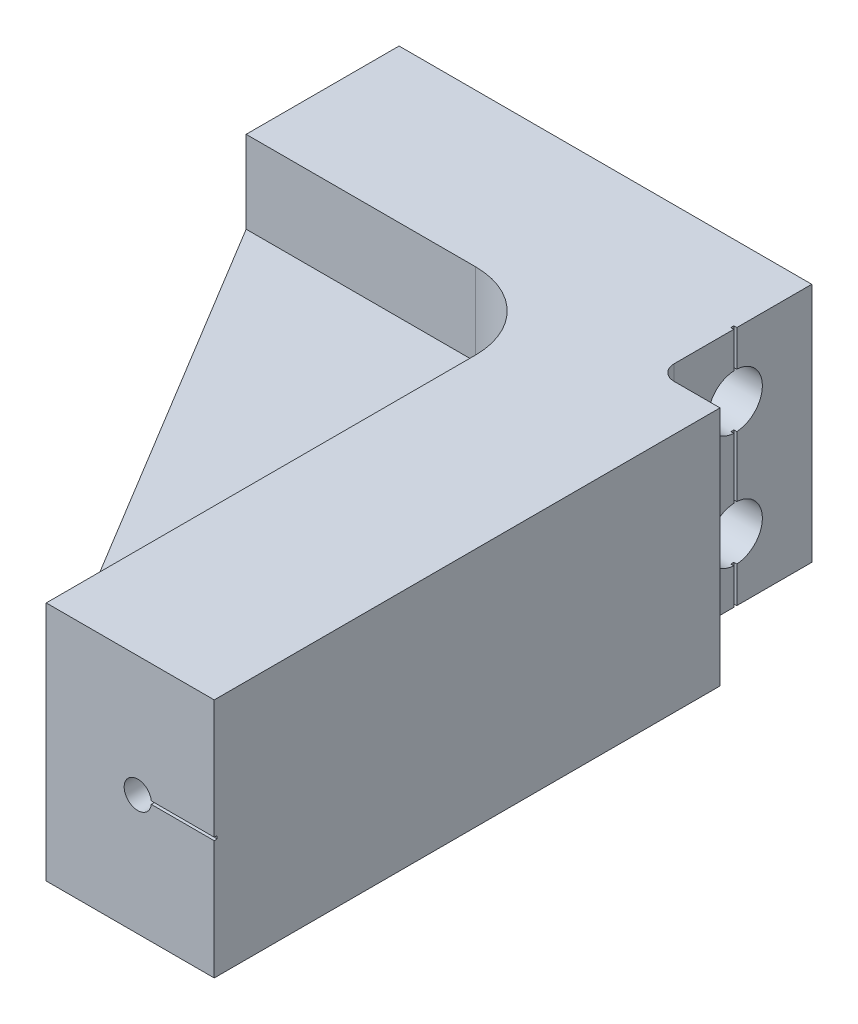
ISO-10303-21;
HEADER;
FILE_DESCRIPTION(('STEP AP214'),'2;1');
FILE_NAME('part.step','',(''),(''),'','','');
FILE_SCHEMA(('AUTOMOTIVE_DESIGN { 1 0 10303 214 1 1 1 1 }'));
ENDSEC;
DATA;
#1=APPLICATION_CONTEXT('core data for automotive mechanical design processes');
#2=APPLICATION_PROTOCOL_DEFINITION('international standard','automotive_design',2000,#1);
#3=PRODUCT_CONTEXT('',#1,'mechanical');
#4=PRODUCT('Part','Part','',(#3));
#5=PRODUCT_RELATED_PRODUCT_CATEGORY('part','',(#4));
#6=PRODUCT_DEFINITION_FORMATION('','',#4);
#7=PRODUCT_DEFINITION_CONTEXT('part definition',#1,'design');
#8=PRODUCT_DEFINITION('design','',#6,#7);
#9=PRODUCT_DEFINITION_SHAPE('','',#8);
#10=(LENGTH_UNIT() NAMED_UNIT(*) SI_UNIT(.MILLI.,.METRE.));
#11=(NAMED_UNIT(*) PLANE_ANGLE_UNIT() SI_UNIT($,.RADIAN.));
#12=(NAMED_UNIT(*) SI_UNIT($,.STERADIAN.) SOLID_ANGLE_UNIT());
#13=UNCERTAINTY_MEASURE_WITH_UNIT(LENGTH_MEASURE(1.E-05),#10,'distance_accuracy_value','');
#14=(GEOMETRIC_REPRESENTATION_CONTEXT(3) GLOBAL_UNCERTAINTY_ASSIGNED_CONTEXT((#13)) GLOBAL_UNIT_ASSIGNED_CONTEXT((#10,
#11,#12)) REPRESENTATION_CONTEXT('',''));
#15=CARTESIAN_POINT('',(0.,0.,0.));
#16=DIRECTION('',(0.,0.,1.));
#17=DIRECTION('',(1.,0.,0.));
#18=AXIS2_PLACEMENT_3D('',#15,#16,#17);
#19=CARTESIAN_POINT('',(10.3,10.,54.6999999999998));
#20=DIRECTION('',(1.,0.,0.));
#21=DIRECTION('',(0.,0.,-0.999999999999998));
#22=AXIS2_PLACEMENT_3D('',#19,#20,#21);
#23=PLANE('',#22);
#24=DIRECTION('',(0.,0.,-0.999999999999998));
#25=VECTOR('',#24,1.);
#26=CARTESIAN_POINT('',(10.3,3.175,54.6999999999998));
#27=LINE('',#26,#25);
#28=CARTESIAN_POINT('',(10.3,3.175,54.6999999999998));
#29=VERTEX_POINT('',#28);
#30=CARTESIAN_POINT('',(10.3,3.175,19.0499999999999));
#31=VERTEX_POINT('',#30);
#32=EDGE_CURVE('E323',#29,#31,#27,.T.);
#33=ORIENTED_EDGE('',*,*,#32,.F.);
#34=DIRECTION('',(0.,-1.,0.));
#35=VECTOR('',#34,1.);
#36=CARTESIAN_POINT('',(10.3,10.,54.6999999999998));
#37=LINE('',#36,#35);
#38=CARTESIAN_POINT('',(10.3,10.,54.6999999999998));
#39=VERTEX_POINT('',#38);
#40=EDGE_CURVE('E457',#39,#29,#37,.T.);
#41=ORIENTED_EDGE('',*,*,#40,.F.);
#42=DIRECTION('',(0.,0.,0.999999999999998));
#43=VECTOR('',#42,1.);
#44=CARTESIAN_POINT('',(10.3,10.,54.6999999999998));
#45=LINE('',#44,#43);
#46=CARTESIAN_POINT('',(10.3,10.,19.0499999999999));
#47=VERTEX_POINT('',#46);
#48=EDGE_CURVE('E453',#47,#39,#45,.T.);
#49=ORIENTED_EDGE('',*,*,#48,.F.);
#50=DIRECTION('',(0.,-1.,0.));
#51=VECTOR('',#50,1.);
#52=CARTESIAN_POINT('',(10.3,10.,19.0499999999999));
#53=LINE('',#52,#51);
#54=EDGE_CURVE('E462',#47,#31,#53,.T.);
#55=ORIENTED_EDGE('',*,*,#54,.T.);
#56=EDGE_LOOP('',(#33,#41,#49,#55));
#57=FACE_BOUND('',#56,.T.);
#58=ADVANCED_FACE('F35',(#57),#23,.F.);
#59=CARTESIAN_POINT('',(3.95,10.,19.0499999999999));
#60=DIRECTION('',(0.,-1.,0.));
#61=DIRECTION('',(0.,0.,-0.999999999999998));
#62=AXIS2_PLACEMENT_3D('',#59,#60,#61);
#63=CYLINDRICAL_SURFACE('',#62,6.35);
#64=CARTESIAN_POINT('',(3.95000000000001,3.175,19.0499999999999));
#65=DIRECTION('',(0.,-1.,0.));
#66=DIRECTION('',(0.,0.,-0.999999999999998));
#67=AXIS2_PLACEMENT_3D('',#64,#65,#66);
#68=CIRCLE('',#67,6.35);
#69=CARTESIAN_POINT('',(3.95000000000001,3.175,12.7));
#70=VERTEX_POINT('',#69);
#71=EDGE_CURVE('E333',#31,#70,#68,.F.);
#72=ORIENTED_EDGE('',*,*,#71,.F.);
#73=ORIENTED_EDGE('',*,*,#54,.F.);
#74=CARTESIAN_POINT('',(3.95,10.,19.0499999999999));
#75=DIRECTION('',(0.,-1.,0.));
#76=DIRECTION('',(0.,0.,-0.999999999999998));
#77=AXIS2_PLACEMENT_3D('',#74,#75,#76);
#78=CIRCLE('',#77,6.35);
#79=CARTESIAN_POINT('',(3.95,10.,12.7));
#80=VERTEX_POINT('',#79);
#81=EDGE_CURVE('E450',#80,#47,#78,.T.);
#82=ORIENTED_EDGE('',*,*,#81,.F.);
#83=DIRECTION('',(0.,-1.,0.));
#84=VECTOR('',#83,1.);
#85=CARTESIAN_POINT('',(3.95,10.,12.7));
#86=LINE('',#85,#84);
#87=EDGE_CURVE('E466',#80,#70,#86,.T.);
#88=ORIENTED_EDGE('',*,*,#87,.T.);
#89=EDGE_LOOP('',(#72,#73,#82,#88));
#90=FACE_BOUND('',#89,.T.);
#91=ADVANCED_FACE('F484',(#90),#63,.F.);
#92=CARTESIAN_POINT('',(0.,10.,12.7));
#93=DIRECTION('',(0.,0.,-0.999999999999998));
#94=DIRECTION('',(-1.,0.,0.));
#95=AXIS2_PLACEMENT_3D('',#92,#93,#94);
#96=PLANE('',#95);
#97=DIRECTION('',(-1.,0.,0.));
#98=VECTOR('',#97,1.);
#99=CARTESIAN_POINT('',(10.3,3.175,12.7));
#100=LINE('',#99,#98);
#101=CARTESIAN_POINT('',(-15.1,3.175,12.7));
#102=VERTEX_POINT('',#101);
#103=EDGE_CURVE('E320',#70,#102,#100,.T.);
#104=ORIENTED_EDGE('',*,*,#103,.F.);
#105=ORIENTED_EDGE('',*,*,#87,.F.);
#106=DIRECTION('',(1.,0.,0.));
#107=VECTOR('',#106,1.);
#108=CARTESIAN_POINT('',(0.,10.,12.7));
#109=LINE('',#108,#107);
#110=CARTESIAN_POINT('',(-15.1,10.,12.7));
#111=VERTEX_POINT('',#110);
#112=EDGE_CURVE('E447',#111,#80,#109,.T.);
#113=ORIENTED_EDGE('',*,*,#112,.F.);
#114=DIRECTION('',(0.,1.,0.));
#115=VECTOR('',#114,1.);
#116=CARTESIAN_POINT('',(-15.1,-10.,12.7));
#117=LINE('',#116,#115);
#118=EDGE_CURVE('E431',#102,#111,#117,.T.);
#119=ORIENTED_EDGE('',*,*,#118,.F.);
#120=EDGE_LOOP('',(#104,#105,#113,#119));
#121=FACE_BOUND('',#120,.T.);
#122=ADVANCED_FACE('F487',(#121),#96,.F.);
#123=CARTESIAN_POINT('',(19.17,-10.,12.7));
#124=DIRECTION('',(1.,0.,0.));
#125=DIRECTION('',(0.,0.,-0.999999999999998));
#126=AXIS2_PLACEMENT_3D('',#123,#124,#125);
#127=PLANE('',#126);
#128=DIRECTION('',(0.,-1.,0.));
#129=VECTOR('',#128,1.);
#130=CARTESIAN_POINT('',(19.17,10.,6.475));
#131=LINE('',#130,#129);
#132=CARTESIAN_POINT('',(19.17,10.,6.475));
#133=VERTEX_POINT('',#132);
#134=CARTESIAN_POINT('',(19.17,7.00692184314802,6.475));
#135=VERTEX_POINT('',#134);
#136=EDGE_CURVE('E335',#133,#135,#131,.T.);
#137=ORIENTED_EDGE('',*,*,#136,.F.);
#138=DIRECTION('',(0.,0.,0.999999999999998));
#139=VECTOR('',#138,1.);
#140=CARTESIAN_POINT('',(19.17,10.,12.7));
#141=LINE('',#140,#139);
#142=CARTESIAN_POINT('',(19.17,10.,11.43));
#143=VERTEX_POINT('',#142);
#144=EDGE_CURVE('E404',#133,#143,#141,.T.);
#145=ORIENTED_EDGE('',*,*,#144,.T.);
#146=DIRECTION('',(0.,-1.,0.));
#147=VECTOR('',#146,1.);
#148=CARTESIAN_POINT('',(19.17,-10.,11.43));
#149=LINE('',#148,#147);
#150=CARTESIAN_POINT('',(19.17,-10.,11.43));
#151=VERTEX_POINT('',#150);
#152=EDGE_CURVE('E274',#143,#151,#149,.T.);
#153=ORIENTED_EDGE('',*,*,#152,.T.);
#154=DIRECTION('',(0.,0.,-0.999999999999998));
#155=VECTOR('',#154,1.);
#156=CARTESIAN_POINT('',(19.17,-10.,12.7));
#157=LINE('',#156,#155);
#158=CARTESIAN_POINT('',(19.17,-10.,6.47499999999999));
#159=VERTEX_POINT('',#158);
#160=EDGE_CURVE('E399',#151,#159,#157,.T.);
#161=ORIENTED_EDGE('',*,*,#160,.T.);
#162=DIRECTION('',(0.,-1.,0.));
#163=VECTOR('',#162,1.);
#164=CARTESIAN_POINT('',(19.17,-10.,6.47499999999999));
#165=LINE('',#164,#163);
#166=CARTESIAN_POINT('',(19.17,-7.00692184314802,6.47499999999999));
#167=VERTEX_POINT('',#166);
#168=EDGE_CURVE('E292',#167,#159,#165,.T.);
#169=ORIENTED_EDGE('',*,*,#168,.F.);
#170=CARTESIAN_POINT('',(19.17,-4.7625,6.34999999999999));
#171=DIRECTION('',(1.,0.,0.));
#172=DIRECTION('',(0.,0.,-0.999999999999998));
#173=AXIS2_PLACEMENT_3D('',#170,#171,#172);
#174=CIRCLE('',#173,2.24789999999999);
#175=CARTESIAN_POINT('',(19.17,-2.51807815685198,6.47499999999999));
#176=VERTEX_POINT('',#175);
#177=EDGE_CURVE('E414',#167,#176,#174,.F.);
#178=ORIENTED_EDGE('',*,*,#177,.T.);
#179=CARTESIAN_POINT('',(19.17,2.51807815685198,6.47499999999999));
#180=VERTEX_POINT('',#179);
#181=EDGE_CURVE('E294',#180,#176,#165,.T.);
#182=ORIENTED_EDGE('',*,*,#181,.F.);
#183=CARTESIAN_POINT('',(19.17,4.7625,6.35));
#184=DIRECTION('',(1.,0.,0.));
#185=DIRECTION('',(0.,0.,-0.999999999999998));
#186=AXIS2_PLACEMENT_3D('',#183,#184,#185);
#187=CIRCLE('',#186,2.24789999999999);
#188=EDGE_CURVE('E278',#180,#135,#187,.F.);
#189=ORIENTED_EDGE('',*,*,#188,.T.);
#190=EDGE_LOOP('',(#137,#145,#153,#161,#169,#178,#182,#189));
#191=FACE_BOUND('',#190,.T.);
#192=ADVANCED_FACE('F527',(#191),#127,.T.);
#193=CARTESIAN_POINT('',(24.25,10.,0.));
#194=DIRECTION('',(0.,0.,-0.999999999999998));
#195=DIRECTION('',(-1.,0.,0.));
#196=AXIS2_PLACEMENT_3D('',#193,#194,#195);
#197=PLANE('',#196);
#198=DIRECTION('',(-1.,0.,0.));
#199=VECTOR('',#198,1.);
#200=CARTESIAN_POINT('',(0.,10.,0.));
#201=LINE('',#200,#199);
#202=CARTESIAN_POINT('',(19.17,10.,0.));
#203=VERTEX_POINT('',#202);
#204=CARTESIAN_POINT('',(-15.1,10.,0.));
#205=VERTEX_POINT('',#204);
#206=EDGE_CURVE('E460',#203,#205,#201,.T.);
#207=ORIENTED_EDGE('',*,*,#206,.F.);
#208=DIRECTION('',(0.,1.,0.));
#209=VECTOR('',#208,1.);
#210=CARTESIAN_POINT('',(19.17,10.,0.));
#211=LINE('',#210,#209);
#212=CARTESIAN_POINT('',(19.17,-10.,0.));
#213=VERTEX_POINT('',#212);
#214=EDGE_CURVE('E402',#213,#203,#211,.T.);
#215=ORIENTED_EDGE('',*,*,#214,.F.);
#216=DIRECTION('',(1.,0.,0.));
#217=VECTOR('',#216,1.);
#218=CARTESIAN_POINT('',(0.,-10.,0.));
#219=LINE('',#218,#217);
#220=CARTESIAN_POINT('',(-15.1,-10.,0.));
#221=VERTEX_POINT('',#220);
#222=EDGE_CURVE('E470',#221,#213,#219,.T.);
#223=ORIENTED_EDGE('',*,*,#222,.F.);
#224=DIRECTION('',(0.,-1.,0.));
#225=VECTOR('',#224,1.);
#226=CARTESIAN_POINT('',(-15.1,-10.,0.));
#227=LINE('',#226,#225);
#228=EDGE_CURVE('E425',#205,#221,#227,.T.);
#229=ORIENTED_EDGE('',*,*,#228,.F.);
#230=EDGE_LOOP('',(#207,#215,#223,#229));
#231=FACE_BOUND('',#230,.T.);
#232=ADVANCED_FACE('F584',(#231),#197,.T.);
#233=CARTESIAN_POINT('',(24.25,-4.7625,6.34999999999999));
#234=DIRECTION('',(1.,0.,0.));
#235=DIRECTION('',(0.,0.,-0.999999999999998));
#236=AXIS2_PLACEMENT_3D('',#233,#234,#235);
#237=CYLINDRICAL_SURFACE('',#236,2.24789999999999);
#238=ORIENTED_EDGE('',*,*,#177,.F.);
#239=DIRECTION('',(1.,0.,0.));
#240=VECTOR('',#239,1.);
#241=CARTESIAN_POINT('',(24.25,-7.00692184314802,6.47499999999999));
#242=LINE('',#241,#240);
#243=CARTESIAN_POINT('',(18.92,-7.00692184314802,6.47499999999999));
#244=VERTEX_POINT('',#243);
#245=EDGE_CURVE('E386',#167,#244,#242,.F.);
#246=ORIENTED_EDGE('',*,*,#245,.T.);
#247=CARTESIAN_POINT('',(18.92,-4.7625,6.34999999999999));
#248=DIRECTION('',(1.,0.,0.));
#249=DIRECTION('',(0.,0.,-0.999999999999998));
#250=AXIS2_PLACEMENT_3D('',#247,#248,#249);
#251=CIRCLE('',#250,2.24789999999999);
#252=CARTESIAN_POINT('',(18.92,-7.00692184314802,6.22499999999999));
#253=VERTEX_POINT('',#252);
#254=EDGE_CURVE('E394',#253,#244,#251,.F.);
#255=ORIENTED_EDGE('',*,*,#254,.F.);
#256=DIRECTION('',(1.,0.,0.));
#257=VECTOR('',#256,1.);
#258=CARTESIAN_POINT('',(24.25,-7.00692184314802,6.22499999999999));
#259=LINE('',#258,#257);
#260=CARTESIAN_POINT('',(19.17,-7.00692184314802,6.22499999999999));
#261=VERTEX_POINT('',#260);
#262=EDGE_CURVE('E371',#253,#261,#259,.T.);
#263=ORIENTED_EDGE('',*,*,#262,.T.);
#264=CARTESIAN_POINT('',(19.17,-2.51807815685198,6.22499999999999));
#265=VERTEX_POINT('',#264);
#266=EDGE_CURVE('E411',#265,#261,#174,.F.);
#267=ORIENTED_EDGE('',*,*,#266,.F.);
#268=DIRECTION('',(1.,0.,0.));
#269=VECTOR('',#268,1.);
#270=CARTESIAN_POINT('',(24.25,-2.51807815685198,6.22499999999999));
#271=LINE('',#270,#269);
#272=CARTESIAN_POINT('',(18.92,-2.51807815685198,6.22499999999999));
#273=VERTEX_POINT('',#272);
#274=EDGE_CURVE('E374',#265,#273,#271,.F.);
#275=ORIENTED_EDGE('',*,*,#274,.T.);
#276=CARTESIAN_POINT('',(18.92,-2.51807815685198,6.47499999999999));
#277=VERTEX_POINT('',#276);
#278=EDGE_CURVE('E392',#277,#273,#251,.F.);
#279=ORIENTED_EDGE('',*,*,#278,.F.);
#280=DIRECTION('',(1.,0.,0.));
#281=VECTOR('',#280,1.);
#282=CARTESIAN_POINT('',(24.25,-2.51807815685198,6.47499999999999));
#283=LINE('',#282,#281);
#284=EDGE_CURVE('E383',#277,#176,#283,.T.);
#285=ORIENTED_EDGE('',*,*,#284,.T.);
#286=EDGE_LOOP('',(#238,#246,#255,#263,#267,#275,#279,#285));
#287=FACE_BOUND('',#286,.T.);
#288=CARTESIAN_POINT('',(-15.1,-4.7625,6.34999999999999));
#289=DIRECTION('',(1.,0.,0.));
#290=DIRECTION('',(0.,0.,-0.999999999999998));
#291=AXIS2_PLACEMENT_3D('',#288,#289,#290);
#292=CIRCLE('',#291,2.24789999999999);
#293=CARTESIAN_POINT('',(-15.1,-4.7625,4.10210000000001));
#294=VERTEX_POINT('',#293);
#295=EDGE_CURVE('E422',#294,#294,#292,.T.);
#296=ORIENTED_EDGE('',*,*,#295,.F.);
#297=EDGE_LOOP('',(#296));
#298=FACE_BOUND('',#297,.T.);
#299=ADVANCED_FACE('F538',(#287,#298),#237,.F.);
#300=CARTESIAN_POINT('',(24.25,4.7625,6.35));
#301=DIRECTION('',(1.,0.,0.));
#302=DIRECTION('',(0.,0.,-0.999999999999998));
#303=AXIS2_PLACEMENT_3D('',#300,#301,#302);
#304=CYLINDRICAL_SURFACE('',#303,2.24789999999999);
#305=ORIENTED_EDGE('',*,*,#188,.F.);
#306=DIRECTION('',(1.,0.,0.));
#307=VECTOR('',#306,1.);
#308=CARTESIAN_POINT('',(24.25,2.51807815685198,6.47499999999999));
#309=LINE('',#308,#307);
#310=CARTESIAN_POINT('',(18.92,2.51807815685198,6.47499999999999));
#311=VERTEX_POINT('',#310);
#312=EDGE_CURVE('E380',#180,#311,#309,.F.);
#313=ORIENTED_EDGE('',*,*,#312,.T.);
#314=CARTESIAN_POINT('',(18.92,4.7625,6.35));
#315=DIRECTION('',(1.,0.,0.));
#316=DIRECTION('',(0.,0.,-0.999999999999998));
#317=AXIS2_PLACEMENT_3D('',#314,#315,#316);
#318=CIRCLE('',#317,2.24789999999999);
#319=CARTESIAN_POINT('',(18.92,2.51807815685198,6.225));
#320=VERTEX_POINT('',#319);
#321=EDGE_CURVE('E391',#320,#311,#318,.F.);
#322=ORIENTED_EDGE('',*,*,#321,.F.);
#323=DIRECTION('',(1.,0.,0.));
#324=VECTOR('',#323,1.);
#325=CARTESIAN_POINT('',(24.25,2.51807815685198,6.225));
#326=LINE('',#325,#324);
#327=CARTESIAN_POINT('',(19.17,2.51807815685198,6.225));
#328=VERTEX_POINT('',#327);
#329=EDGE_CURVE('E358',#320,#328,#326,.T.);
#330=ORIENTED_EDGE('',*,*,#329,.T.);
#331=CARTESIAN_POINT('',(19.17,7.00692184314802,6.225));
#332=VERTEX_POINT('',#331);
#333=EDGE_CURVE('E275',#332,#328,#187,.F.);
#334=ORIENTED_EDGE('',*,*,#333,.F.);
#335=DIRECTION('',(1.,0.,0.));
#336=VECTOR('',#335,1.);
#337=CARTESIAN_POINT('',(24.25,7.00692184314802,6.225));
#338=LINE('',#337,#336);
#339=CARTESIAN_POINT('',(18.92,7.00692184314802,6.225));
#340=VERTEX_POINT('',#339);
#341=EDGE_CURVE('E368',#332,#340,#338,.F.);
#342=ORIENTED_EDGE('',*,*,#341,.T.);
#343=CARTESIAN_POINT('',(18.92,7.00692184314802,6.47499999999999));
#344=VERTEX_POINT('',#343);
#345=EDGE_CURVE('E389',#344,#340,#318,.F.);
#346=ORIENTED_EDGE('',*,*,#345,.F.);
#347=DIRECTION('',(1.,0.,0.));
#348=VECTOR('',#347,1.);
#349=CARTESIAN_POINT('',(24.25,7.00692184314802,6.47499999999999));
#350=LINE('',#349,#348);
#351=EDGE_CURVE('E377',#344,#135,#350,.T.);
#352=ORIENTED_EDGE('',*,*,#351,.T.);
#353=EDGE_LOOP('',(#305,#313,#322,#330,#334,#342,#346,#352));
#354=FACE_BOUND('',#353,.T.);
#355=CARTESIAN_POINT('',(-15.1,4.7625,6.35));
#356=DIRECTION('',(1.,0.,0.));
#357=DIRECTION('',(0.,0.,-0.999999999999998));
#358=AXIS2_PLACEMENT_3D('',#355,#356,#357);
#359=CIRCLE('',#358,2.24789999999999);
#360=CARTESIAN_POINT('',(-15.1,4.7625,4.10210000000002));
#361=VERTEX_POINT('',#360);
#362=EDGE_CURVE('E419',#361,#361,#359,.T.);
#363=ORIENTED_EDGE('',*,*,#362,.F.);
#364=EDGE_LOOP('',(#363));
#365=FACE_BOUND('',#364,.T.);
#366=ADVANCED_FACE('F566',(#354,#365),#304,.F.);
#367=CARTESIAN_POINT('',(0.,10.,54.6999999999998));
#368=DIRECTION('',(0.,-1.,0.));
#369=DIRECTION('',(1.,0.,0.));
#370=AXIS2_PLACEMENT_3D('',#367,#368,#369);
#371=PLANE('',#370);
#372=ORIENTED_EDGE('',*,*,#144,.F.);
#373=DIRECTION('',(1.,0.,0.));
#374=VECTOR('',#373,1.);
#375=CARTESIAN_POINT('',(18.92,10.,6.475));
#376=LINE('',#375,#374);
#377=CARTESIAN_POINT('',(18.92,10.,6.475));
#378=VERTEX_POINT('',#377);
#379=EDGE_CURVE('E356',#378,#133,#376,.T.);
#380=ORIENTED_EDGE('',*,*,#379,.F.);
#381=DIRECTION('',(0.,0.,0.999999999999998));
#382=VECTOR('',#381,1.);
#383=CARTESIAN_POINT('',(18.92,10.,6.475));
#384=LINE('',#383,#382);
#385=CARTESIAN_POINT('',(18.92,10.,6.225));
#386=VERTEX_POINT('',#385);
#387=EDGE_CURVE('E351',#386,#378,#384,.T.);
#388=ORIENTED_EDGE('',*,*,#387,.F.);
#389=DIRECTION('',(1.,0.,0.));
#390=VECTOR('',#389,1.);
#391=CARTESIAN_POINT('',(18.92,10.,6.225));
#392=LINE('',#391,#390);
#393=CARTESIAN_POINT('',(19.17,10.,6.225));
#394=VERTEX_POINT('',#393);
#395=EDGE_CURVE('E359',#386,#394,#392,.T.);
#396=ORIENTED_EDGE('',*,*,#395,.T.);
#397=EDGE_CURVE('E405',#203,#394,#141,.T.);
#398=ORIENTED_EDGE('',*,*,#397,.F.);
#399=ORIENTED_EDGE('',*,*,#206,.T.);
#400=DIRECTION('',(0.,0.,-0.999999999999998));
#401=VECTOR('',#400,1.);
#402=CARTESIAN_POINT('',(-15.1,10.,0.));
#403=LINE('',#402,#401);
#404=EDGE_CURVE('E435',#111,#205,#403,.T.);
#405=ORIENTED_EDGE('',*,*,#404,.F.);
#406=ORIENTED_EDGE('',*,*,#112,.T.);
#407=ORIENTED_EDGE('',*,*,#81,.T.);
#408=ORIENTED_EDGE('',*,*,#48,.T.);
#409=DIRECTION('',(-1.,0.,0.));
#410=VECTOR('',#409,1.);
#411=CARTESIAN_POINT('',(0.,10.,54.6999999999998));
#412=LINE('',#411,#410);
#413=CARTESIAN_POINT('',(24.25,10.,54.6999999999998));
#414=VERTEX_POINT('',#413);
#415=EDGE_CURVE('E266',#414,#39,#412,.T.);
#416=ORIENTED_EDGE('',*,*,#415,.F.);
#417=DIRECTION('',(0.,0.,-0.999999999999998));
#418=VECTOR('',#417,1.);
#419=CARTESIAN_POINT('',(24.25,10.,54.6999999999998));
#420=LINE('',#419,#418);
#421=CARTESIAN_POINT('',(24.25,10.,12.7));
#422=VERTEX_POINT('',#421);
#423=EDGE_CURVE('E261',#414,#422,#420,.T.);
#424=ORIENTED_EDGE('',*,*,#423,.T.);
#425=DIRECTION('',(1.,0.,0.));
#426=VECTOR('',#425,1.);
#427=CARTESIAN_POINT('',(19.17,10.,12.7));
#428=LINE('',#427,#426);
#429=CARTESIAN_POINT('',(20.44,10.,12.7));
#430=VERTEX_POINT('',#429);
#431=EDGE_CURVE('E279',#430,#422,#428,.T.);
#432=ORIENTED_EDGE('',*,*,#431,.F.);
#433=CARTESIAN_POINT('',(20.44,10.,11.43));
#434=DIRECTION('',(0.,-1.,0.));
#435=DIRECTION('',(1.,0.,0.));
#436=AXIS2_PLACEMENT_3D('',#433,#434,#435);
#437=CIRCLE('',#436,1.27);
#438=EDGE_CURVE('E286',#430,#143,#437,.T.);
#439=ORIENTED_EDGE('',*,*,#438,.T.);
#440=EDGE_LOOP('',(#372,#380,#388,#396,#398,#399,#405,#406,#407,#408,#416,#424,#432,#439));
#441=FACE_BOUND('',#440,.T.);
#442=ADVANCED_FACE('F37',(#441),#371,.F.);
#443=CARTESIAN_POINT('',(0.,-10.,54.6999999999998));
#444=DIRECTION('',(0.,1.,0.));
#445=DIRECTION('',(0.,0.,0.999999999999998));
#446=AXIS2_PLACEMENT_3D('',#443,#444,#445);
#447=PLANE('',#446);
#448=DIRECTION('',(0.,0.,-0.999999999999998));
#449=VECTOR('',#448,1.);
#450=CARTESIAN_POINT('',(18.92,-10.,6.47499999999999));
#451=LINE('',#450,#449);
#452=CARTESIAN_POINT('',(18.92,-10.,6.47499999999999));
#453=VERTEX_POINT('',#452);
#454=CARTESIAN_POINT('',(18.92,-10.,6.22499999999999));
#455=VERTEX_POINT('',#454);
#456=EDGE_CURVE('E343',#453,#455,#451,.T.);
#457=ORIENTED_EDGE('',*,*,#456,.F.);
#458=DIRECTION('',(1.,0.,0.));
#459=VECTOR('',#458,1.);
#460=CARTESIAN_POINT('',(18.92,-10.,6.47499999999999));
#461=LINE('',#460,#459);
#462=EDGE_CURVE('E355',#453,#159,#461,.T.);
#463=ORIENTED_EDGE('',*,*,#462,.T.);
#464=ORIENTED_EDGE('',*,*,#160,.F.);
#465=CARTESIAN_POINT('',(20.44,-10.,11.43));
#466=DIRECTION('',(0.,1.,0.));
#467=DIRECTION('',(0.,0.,0.999999999999998));
#468=AXIS2_PLACEMENT_3D('',#465,#466,#467);
#469=CIRCLE('',#468,1.27);
#470=CARTESIAN_POINT('',(20.44,-10.,12.7));
#471=VERTEX_POINT('',#470);
#472=EDGE_CURVE('E284',#151,#471,#469,.T.);
#473=ORIENTED_EDGE('',*,*,#472,.T.);
#474=DIRECTION('',(1.,0.,0.));
#475=VECTOR('',#474,1.);
#476=CARTESIAN_POINT('',(19.17,-10.,12.7));
#477=LINE('',#476,#475);
#478=CARTESIAN_POINT('',(24.25,-10.,12.7));
#479=VERTEX_POINT('',#478);
#480=EDGE_CURVE('E408',#471,#479,#477,.T.);
#481=ORIENTED_EDGE('',*,*,#480,.T.);
#482=DIRECTION('',(0.,0.,-0.999999999999998));
#483=VECTOR('',#482,1.);
#484=CARTESIAN_POINT('',(24.25,-10.,54.6999999999998));
#485=LINE('',#484,#483);
#486=CARTESIAN_POINT('',(24.25,-10.,54.6999999999998));
#487=VERTEX_POINT('',#486);
#488=EDGE_CURVE('E271',#487,#479,#485,.T.);
#489=ORIENTED_EDGE('',*,*,#488,.F.);
#490=DIRECTION('',(1.,0.,0.));
#491=VECTOR('',#490,1.);
#492=CARTESIAN_POINT('',(0.,-10.,54.6999999999998));
#493=LINE('',#492,#491);
#494=CARTESIAN_POINT('',(10.3,-10.,54.6999999999998));
#495=VERTEX_POINT('',#494);
#496=EDGE_CURVE('E264',#495,#487,#493,.T.);
#497=ORIENTED_EDGE('',*,*,#496,.F.);
#498=DIRECTION('',(0.,0.,0.999999999999998));
#499=VECTOR('',#498,1.);
#500=CARTESIAN_POINT('',(10.3,-10.,54.6999999999998));
#501=LINE('',#500,#499);
#502=CARTESIAN_POINT('',(10.3,-10.,19.0499999999999));
#503=VERTEX_POINT('',#502);
#504=EDGE_CURVE('E444',#503,#495,#501,.T.);
#505=ORIENTED_EDGE('',*,*,#504,.F.);
#506=CARTESIAN_POINT('',(3.95000000000001,-10.,19.0499999999999));
#507=DIRECTION('',(0.,-1.,0.));
#508=DIRECTION('',(0.,0.,-0.999999999999998));
#509=AXIS2_PLACEMENT_3D('',#506,#507,#508);
#510=CIRCLE('',#509,6.35);
#511=CARTESIAN_POINT('',(3.95000000000001,-10.,12.7));
#512=VERTEX_POINT('',#511);
#513=EDGE_CURVE('E441',#512,#503,#510,.T.);
#514=ORIENTED_EDGE('',*,*,#513,.F.);
#515=DIRECTION('',(1.,0.,0.));
#516=VECTOR('',#515,1.);
#517=CARTESIAN_POINT('',(0.,-10.,12.7));
#518=LINE('',#517,#516);
#519=CARTESIAN_POINT('',(-15.1,-10.,12.7));
#520=VERTEX_POINT('',#519);
#521=EDGE_CURVE('E438',#520,#512,#518,.T.);
#522=ORIENTED_EDGE('',*,*,#521,.F.);
#523=DIRECTION('',(0.,0.,0.999999999999998));
#524=VECTOR('',#523,1.);
#525=CARTESIAN_POINT('',(-15.1,-10.,0.));
#526=LINE('',#525,#524);
#527=EDGE_CURVE('E428',#221,#520,#526,.T.);
#528=ORIENTED_EDGE('',*,*,#527,.F.);
#529=ORIENTED_EDGE('',*,*,#222,.T.);
#530=CARTESIAN_POINT('',(19.17,-10.,6.22499999999999));
#531=VERTEX_POINT('',#530);
#532=EDGE_CURVE('E398',#531,#213,#157,.T.);
#533=ORIENTED_EDGE('',*,*,#532,.F.);
#534=DIRECTION('',(1.,0.,0.));
#535=VECTOR('',#534,1.);
#536=CARTESIAN_POINT('',(18.92,-10.,6.22499999999999));
#537=LINE('',#536,#535);
#538=EDGE_CURVE('E362',#455,#531,#537,.T.);
#539=ORIENTED_EDGE('',*,*,#538,.F.);
#540=EDGE_LOOP('',(#457,#463,#464,#473,#481,#489,#497,#505,#514,#522,#528,#529,#533,#539));
#541=FACE_BOUND('',#540,.T.);
#542=ADVANCED_FACE('F514',(#541),#447,.F.);
#543=CARTESIAN_POINT('',(24.25,10.,54.6999999999998));
#544=DIRECTION('',(-1.,0.,0.));
#545=DIRECTION('',(0.,0.,0.999999999999998));
#546=AXIS2_PLACEMENT_3D('',#543,#544,#545);
#547=PLANE('',#546);
#548=DIRECTION('',(0.,1.,0.));
#549=VECTOR('',#548,1.);
#550=CARTESIAN_POINT('',(24.25,0.125,54.4499999999998));
#551=LINE('',#550,#549);
#552=CARTESIAN_POINT('',(24.25,-0.125,54.4499999999998));
#553=VERTEX_POINT('',#552);
#554=CARTESIAN_POINT('',(24.25,0.125,54.4499999999998));
#555=VERTEX_POINT('',#554);
#556=EDGE_CURVE('E307',#553,#555,#551,.T.);
#557=ORIENTED_EDGE('',*,*,#556,.F.);
#558=DIRECTION('',(0.,0.,0.999999999999998));
#559=VECTOR('',#558,1.);
#560=CARTESIAN_POINT('',(24.25,-0.125,54.4499999999998));
#561=LINE('',#560,#559);
#562=CARTESIAN_POINT('',(24.25,-0.125,54.6999999999998));
#563=VERTEX_POINT('',#562);
#564=EDGE_CURVE('E243',#553,#563,#561,.T.);
#565=ORIENTED_EDGE('',*,*,#564,.T.);
#566=DIRECTION('',(0.,1.,0.));
#567=VECTOR('',#566,1.);
#568=CARTESIAN_POINT('',(24.25,10.,54.6999999999998));
#569=LINE('',#568,#567);
#570=EDGE_CURVE('E263',#487,#563,#569,.T.);
#571=ORIENTED_EDGE('',*,*,#570,.F.);
#572=ORIENTED_EDGE('',*,*,#488,.T.);
#573=DIRECTION('',(0.,-1.,0.));
#574=VECTOR('',#573,1.);
#575=CARTESIAN_POINT('',(24.25,10.,12.7));
#576=LINE('',#575,#574);
#577=EDGE_CURVE('E395',#422,#479,#576,.T.);
#578=ORIENTED_EDGE('',*,*,#577,.F.);
#579=ORIENTED_EDGE('',*,*,#423,.F.);
#580=CARTESIAN_POINT('',(24.25,0.125,54.6999999999998));
#581=VERTEX_POINT('',#580);
#582=EDGE_CURVE('E251',#581,#414,#569,.T.);
#583=ORIENTED_EDGE('',*,*,#582,.F.);
#584=DIRECTION('',(0.,0.,0.999999999999998));
#585=VECTOR('',#584,1.);
#586=CARTESIAN_POINT('',(24.25,0.125,54.4499999999998));
#587=LINE('',#586,#585);
#588=EDGE_CURVE('E235',#555,#581,#587,.T.);
#589=ORIENTED_EDGE('',*,*,#588,.F.);
#590=EDGE_LOOP('',(#557,#565,#571,#572,#578,#579,#583,#589));
#591=FACE_BOUND('',#590,.T.);
#592=ADVANCED_FACE('F258',(#591),#547,.F.);
#593=CARTESIAN_POINT('',(24.25,10.,54.6999999999998));
#594=DIRECTION('',(0.,0.,-0.999999999999998));
#595=DIRECTION('',(-1.,0.,0.));
#596=AXIS2_PLACEMENT_3D('',#593,#594,#595);
#597=PLANE('',#596);
#598=ORIENTED_EDGE('',*,*,#570,.T.);
#599=DIRECTION('',(1.,0.,0.));
#600=VECTOR('',#599,1.);
#601=CARTESIAN_POINT('',(24.25,-0.125,54.6999999999998));
#602=LINE('',#601,#600);
#603=CARTESIAN_POINT('',(19.0233668545938,-0.125000000000001,54.6999999999998));
#604=VERTEX_POINT('',#603);
#605=EDGE_CURVE('E256',#604,#563,#602,.T.);
#606=ORIENTED_EDGE('',*,*,#605,.F.);
#607=CARTESIAN_POINT('',(17.9,0.,54.6999999999998));
#608=DIRECTION('',(0.,0.,0.999999999999998));
#609=DIRECTION('',(1.,0.,0.));
#610=AXIS2_PLACEMENT_3D('',#607,#608,#609);
#611=CIRCLE('',#610,1.13029999999999);
#612=CARTESIAN_POINT('',(19.0233668545938,0.125000000000001,54.6999999999998));
#613=VERTEX_POINT('',#612);
#614=EDGE_CURVE('E255',#613,#604,#611,.T.);
#615=ORIENTED_EDGE('',*,*,#614,.F.);
#616=DIRECTION('',(-1.,0.,0.));
#617=VECTOR('',#616,1.);
#618=CARTESIAN_POINT('',(24.25,0.125,54.6999999999998));
#619=LINE('',#618,#617);
#620=EDGE_CURVE('E238',#581,#613,#619,.T.);
#621=ORIENTED_EDGE('',*,*,#620,.F.);
#622=ORIENTED_EDGE('',*,*,#582,.T.);
#623=ORIENTED_EDGE('',*,*,#415,.T.);
#624=ORIENTED_EDGE('',*,*,#40,.T.);
#625=DIRECTION('',(0.,-1.,0.));
#626=VECTOR('',#625,1.);
#627=CARTESIAN_POINT('',(10.3,3.175,54.6999999999998));
#628=LINE('',#627,#626);
#629=CARTESIAN_POINT('',(10.3,-3.175,54.6999999999998));
#630=VERTEX_POINT('',#629);
#631=EDGE_CURVE('E325',#29,#630,#628,.T.);
#632=ORIENTED_EDGE('',*,*,#631,.T.);
#633=EDGE_CURVE('E461',#630,#495,#37,.T.);
#634=ORIENTED_EDGE('',*,*,#633,.T.);
#635=ORIENTED_EDGE('',*,*,#496,.T.);
#636=EDGE_LOOP('',(#598,#606,#615,#621,#622,#623,#624,#632,#634,#635));
#637=FACE_BOUND('',#636,.T.);
#638=ADVANCED_FACE('F249',(#637),#597,.F.);
#639=ORIENTED_EDGE('',*,*,#633,.F.);
#640=DIRECTION('',(0.,0.,-0.999999999999998));
#641=VECTOR('',#640,1.);
#642=CARTESIAN_POINT('',(10.3,-3.175,54.6999999999998));
#643=LINE('',#642,#641);
#644=CARTESIAN_POINT('',(10.3,-3.175,19.0499999999999));
#645=VERTEX_POINT('',#644);
#646=EDGE_CURVE('E317',#630,#645,#643,.T.);
#647=ORIENTED_EDGE('',*,*,#646,.T.);
#648=EDGE_CURVE('E465',#645,#503,#53,.T.);
#649=ORIENTED_EDGE('',*,*,#648,.T.);
#650=ORIENTED_EDGE('',*,*,#504,.T.);
#651=EDGE_LOOP('',(#639,#647,#649,#650));
#652=FACE_BOUND('',#651,.T.);
#653=ADVANCED_FACE('F508',(#652),#23,.F.);
#654=ORIENTED_EDGE('',*,*,#648,.F.);
#655=CARTESIAN_POINT('',(3.95000000000001,-3.175,19.0499999999999));
#656=DIRECTION('',(0.,-1.,0.));
#657=DIRECTION('',(0.,0.,-0.999999999999998));
#658=AXIS2_PLACEMENT_3D('',#655,#656,#657);
#659=CIRCLE('',#658,6.35);
#660=CARTESIAN_POINT('',(3.95000000000001,-3.175,12.7));
#661=VERTEX_POINT('',#660);
#662=EDGE_CURVE('E330',#645,#661,#659,.F.);
#663=ORIENTED_EDGE('',*,*,#662,.T.);
#664=EDGE_CURVE('E456',#661,#512,#86,.T.);
#665=ORIENTED_EDGE('',*,*,#664,.T.);
#666=ORIENTED_EDGE('',*,*,#513,.T.);
#667=EDGE_LOOP('',(#654,#663,#665,#666));
#668=FACE_BOUND('',#667,.T.);
#669=ADVANCED_FACE('F503',(#668),#63,.F.);
#670=ORIENTED_EDGE('',*,*,#664,.F.);
#671=DIRECTION('',(-1.,0.,0.));
#672=VECTOR('',#671,1.);
#673=CARTESIAN_POINT('',(10.3,-3.175,12.7));
#674=LINE('',#673,#672);
#675=CARTESIAN_POINT('',(-15.1,-3.175,12.7));
#676=VERTEX_POINT('',#675);
#677=EDGE_CURVE('E311',#661,#676,#674,.T.);
#678=ORIENTED_EDGE('',*,*,#677,.T.);
#679=EDGE_CURVE('E432',#520,#676,#117,.T.);
#680=ORIENTED_EDGE('',*,*,#679,.F.);
#681=ORIENTED_EDGE('',*,*,#521,.T.);
#682=EDGE_LOOP('',(#670,#678,#680,#681));
#683=FACE_BOUND('',#682,.T.);
#684=ADVANCED_FACE('F498',(#683),#96,.F.);
#685=CARTESIAN_POINT('',(-15.1,10.,0.));
#686=DIRECTION('',(1.,0.,0.));
#687=DIRECTION('',(0.,0.,-0.999999999999998));
#688=AXIS2_PLACEMENT_3D('',#685,#686,#687);
#689=PLANE('',#688);
#690=ORIENTED_EDGE('',*,*,#362,.T.);
#691=EDGE_LOOP('',(#690));
#692=FACE_BOUND('',#691,.T.);
#693=ORIENTED_EDGE('',*,*,#295,.T.);
#694=EDGE_LOOP('',(#693));
#695=FACE_BOUND('',#694,.T.);
#696=ORIENTED_EDGE('',*,*,#228,.T.);
#697=ORIENTED_EDGE('',*,*,#527,.T.);
#698=ORIENTED_EDGE('',*,*,#679,.T.);
#699=DIRECTION('',(0.,-1.,0.));
#700=VECTOR('',#699,1.);
#701=CARTESIAN_POINT('',(-15.1,3.175,12.7));
#702=LINE('',#701,#700);
#703=EDGE_CURVE('E328',#102,#676,#702,.T.);
#704=ORIENTED_EDGE('',*,*,#703,.F.);
#705=ORIENTED_EDGE('',*,*,#118,.T.);
#706=ORIENTED_EDGE('',*,*,#404,.T.);
#707=EDGE_LOOP('',(#696,#697,#698,#704,#705,#706));
#708=FACE_BOUND('',#707,.T.);
#709=ADVANCED_FACE('F492',(#692,#695,#708),#689,.F.);
#710=CARTESIAN_POINT('',(17.9,0.,54.6999999999998));
#711=DIRECTION('',(0.,0.,0.999999999999998));
#712=DIRECTION('',(1.,0.,0.));
#713=AXIS2_PLACEMENT_3D('',#710,#711,#712);
#714=CYLINDRICAL_SURFACE('',#713,1.13029999999999);
#715=ORIENTED_EDGE('',*,*,#614,.T.);
#716=DIRECTION('',(0.,0.,0.999999999999998));
#717=VECTOR('',#716,1.);
#718=CARTESIAN_POINT('',(19.0233668545938,-0.125000000000001,54.6999999999998));
#719=LINE('',#718,#717);
#720=CARTESIAN_POINT('',(19.0233668545938,-0.125000000000001,54.4499999999998));
#721=VERTEX_POINT('',#720);
#722=EDGE_CURVE('E11',#604,#721,#719,.F.);
#723=ORIENTED_EDGE('',*,*,#722,.T.);
#724=CARTESIAN_POINT('',(17.9,0.,54.4499999999998));
#725=DIRECTION('',(0.,0.,-0.999999999999998));
#726=DIRECTION('',(-1.,0.,0.));
#727=AXIS2_PLACEMENT_3D('',#724,#725,#726);
#728=CIRCLE('',#727,1.13029999999999);
#729=CARTESIAN_POINT('',(19.0233668545938,0.125000000000001,54.4499999999998));
#730=VERTEX_POINT('',#729);
#731=EDGE_CURVE('E295',#721,#730,#728,.F.);
#732=ORIENTED_EDGE('',*,*,#731,.T.);
#733=DIRECTION('',(0.,0.,0.999999999999998));
#734=VECTOR('',#733,1.);
#735=CARTESIAN_POINT('',(19.0233668545938,0.125000000000001,54.6999999999998));
#736=LINE('',#735,#734);
#737=EDGE_CURVE('E43',#730,#613,#736,.T.);
#738=ORIENTED_EDGE('',*,*,#737,.T.);
#739=EDGE_LOOP('',(#715,#723,#732,#738));
#740=FACE_BOUND('',#739,.T.);
#741=CARTESIAN_POINT('',(17.9,0.,45.8353999999999));
#742=DIRECTION('',(0.,0.,0.999999999999998));
#743=DIRECTION('',(1.,0.,0.));
#744=AXIS2_PLACEMENT_3D('',#741,#742,#743);
#745=CIRCLE('',#744,1.13029999999999);
#746=CARTESIAN_POINT('',(19.0303,0.,45.8353999999999));
#747=VERTEX_POINT('',#746);
#748=EDGE_CURVE('E415',#747,#747,#745,.T.);
#749=ORIENTED_EDGE('',*,*,#748,.F.);
#750=EDGE_LOOP('',(#749));
#751=FACE_BOUND('',#750,.T.);
#752=ADVANCED_FACE('F298',(#740,#751),#714,.F.);
#753=CARTESIAN_POINT('',(17.9,0.,45.8353999999999));
#754=DIRECTION('',(0.,0.,0.999999999999998));
#755=DIRECTION('',(1.,0.,0.));
#756=AXIS2_PLACEMENT_3D('',#753,#754,#755);
#757=CONICAL_SURFACE('',#756,1.13029999999999,1.02974425867665);
#758=CARTESIAN_POINT('',(17.9,0.,45.1562472423131));
#759=VERTEX_POINT('',#758);
#760=VERTEX_LOOP('',#759);
#761=FACE_BOUND('',#760,.T.);
#762=ORIENTED_EDGE('',*,*,#748,.T.);
#763=EDGE_LOOP('',(#762));
#764=FACE_BOUND('',#763,.T.);
#765=ADVANCED_FACE('F638',(#761,#764),#757,.F.);
#766=DIRECTION('',(0.,1.,0.));
#767=VECTOR('',#766,1.);
#768=CARTESIAN_POINT('',(19.17,10.,6.225));
#769=LINE('',#768,#767);
#770=EDGE_CURVE('E337',#531,#261,#769,.T.);
#771=ORIENTED_EDGE('',*,*,#770,.F.);
#772=ORIENTED_EDGE('',*,*,#532,.T.);
#773=ORIENTED_EDGE('',*,*,#214,.T.);
#774=ORIENTED_EDGE('',*,*,#397,.T.);
#775=DIRECTION('',(0.,1.,0.));
#776=VECTOR('',#775,1.);
#777=CARTESIAN_POINT('',(19.17,-10.,6.22499999999999));
#778=LINE('',#777,#776);
#779=EDGE_CURVE('E289',#332,#394,#778,.T.);
#780=ORIENTED_EDGE('',*,*,#779,.F.);
#781=ORIENTED_EDGE('',*,*,#333,.T.);
#782=EDGE_CURVE('E291',#265,#328,#778,.T.);
#783=ORIENTED_EDGE('',*,*,#782,.F.);
#784=ORIENTED_EDGE('',*,*,#266,.T.);
#785=EDGE_LOOP('',(#771,#772,#773,#774,#780,#781,#783,#784));
#786=FACE_BOUND('',#785,.T.);
#787=ADVANCED_FACE('F558',(#786),#127,.T.);
#788=CARTESIAN_POINT('',(19.17,10.,12.7));
#789=DIRECTION('',(0.,0.,0.999999999999998));
#790=DIRECTION('',(0.,-1.,0.));
#791=AXIS2_PLACEMENT_3D('',#788,#789,#790);
#792=PLANE('',#791);
#793=ORIENTED_EDGE('',*,*,#480,.F.);
#794=DIRECTION('',(0.,-1.,0.));
#795=VECTOR('',#794,1.);
#796=CARTESIAN_POINT('',(20.44,10.,12.7));
#797=LINE('',#796,#795);
#798=EDGE_CURVE('E282',#471,#430,#797,.F.);
#799=ORIENTED_EDGE('',*,*,#798,.T.);
#800=ORIENTED_EDGE('',*,*,#431,.T.);
#801=ORIENTED_EDGE('',*,*,#577,.T.);
#802=EDGE_LOOP('',(#793,#799,#800,#801));
#803=FACE_BOUND('',#802,.T.);
#804=ADVANCED_FACE('F518',(#803),#792,.F.);
#805=CARTESIAN_POINT('',(20.44,-10.,11.43));
#806=DIRECTION('',(0.,-1.,0.));
#807=DIRECTION('',(0.,0.,-0.999999999999998));
#808=AXIS2_PLACEMENT_3D('',#805,#806,#807);
#809=CYLINDRICAL_SURFACE('',#808,1.27);
#810=ORIENTED_EDGE('',*,*,#438,.F.);
#811=ORIENTED_EDGE('',*,*,#798,.F.);
#812=ORIENTED_EDGE('',*,*,#472,.F.);
#813=ORIENTED_EDGE('',*,*,#152,.F.);
#814=EDGE_LOOP('',(#810,#811,#812,#813));
#815=FACE_BOUND('',#814,.T.);
#816=ADVANCED_FACE('F523',(#815),#809,.F.);
#817=CARTESIAN_POINT('',(18.92,10.,6.225));
#818=DIRECTION('',(0.,0.,-0.999999999999998));
#819=DIRECTION('',(0.,1.,0.));
#820=AXIS2_PLACEMENT_3D('',#817,#818,#819);
#821=PLANE('',#820);
#822=ORIENTED_EDGE('',*,*,#779,.T.);
#823=ORIENTED_EDGE('',*,*,#395,.F.);
#824=DIRECTION('',(0.,1.,0.));
#825=VECTOR('',#824,1.);
#826=CARTESIAN_POINT('',(18.92,10.,6.225));
#827=LINE('',#826,#825);
#828=EDGE_CURVE('E347',#340,#386,#827,.T.);
#829=ORIENTED_EDGE('',*,*,#828,.F.);
#830=ORIENTED_EDGE('',*,*,#341,.F.);
#831=EDGE_LOOP('',(#822,#823,#829,#830));
#832=FACE_BOUND('',#831,.T.);
#833=ADVANCED_FACE('F579',(#832),#821,.F.);
#834=CARTESIAN_POINT('',(18.92,10.,6.475));
#835=DIRECTION('',(0.,0.,0.999999999999998));
#836=DIRECTION('',(0.,-1.,0.));
#837=AXIS2_PLACEMENT_3D('',#834,#835,#836);
#838=PLANE('',#837);
#839=DIRECTION('',(0.,-1.,0.));
#840=VECTOR('',#839,1.);
#841=CARTESIAN_POINT('',(18.92,10.,6.475));
#842=LINE('',#841,#840);
#843=EDGE_CURVE('E340',#378,#344,#842,.T.);
#844=ORIENTED_EDGE('',*,*,#843,.F.);
#845=ORIENTED_EDGE('',*,*,#379,.T.);
#846=ORIENTED_EDGE('',*,*,#136,.T.);
#847=ORIENTED_EDGE('',*,*,#351,.F.);
#848=EDGE_LOOP('',(#844,#845,#846,#847));
#849=FACE_BOUND('',#848,.T.);
#850=ADVANCED_FACE('F572',(#849),#838,.F.);
#851=CARTESIAN_POINT('',(18.92,-10.,6.47499999999999));
#852=DIRECTION('',(1.,0.,0.));
#853=DIRECTION('',(0.,0.,-0.999999999999998));
#854=AXIS2_PLACEMENT_3D('',#851,#852,#853);
#855=PLANE('',#854);
#856=ORIENTED_EDGE('',*,*,#345,.T.);
#857=ORIENTED_EDGE('',*,*,#828,.T.);
#858=ORIENTED_EDGE('',*,*,#387,.T.);
#859=ORIENTED_EDGE('',*,*,#843,.T.);
#860=EDGE_LOOP('',(#856,#857,#858,#859));
#861=FACE_BOUND('',#860,.T.);
#862=ADVANCED_FACE('F575',(#861),#855,.T.);
#863=ORIENTED_EDGE('',*,*,#782,.T.);
#864=ORIENTED_EDGE('',*,*,#329,.F.);
#865=EDGE_CURVE('E352',#273,#320,#827,.T.);
#866=ORIENTED_EDGE('',*,*,#865,.F.);
#867=ORIENTED_EDGE('',*,*,#274,.F.);
#868=EDGE_LOOP('',(#863,#864,#866,#867));
#869=FACE_BOUND('',#868,.T.);
#870=ADVANCED_FACE('F563',(#869),#821,.F.);
#871=EDGE_CURVE('E344',#311,#277,#842,.T.);
#872=ORIENTED_EDGE('',*,*,#871,.F.);
#873=ORIENTED_EDGE('',*,*,#312,.F.);
#874=ORIENTED_EDGE('',*,*,#181,.T.);
#875=ORIENTED_EDGE('',*,*,#284,.F.);
#876=EDGE_LOOP('',(#872,#873,#874,#875));
#877=FACE_BOUND('',#876,.T.);
#878=ADVANCED_FACE('F545',(#877),#838,.F.);
#879=ORIENTED_EDGE('',*,*,#278,.T.);
#880=ORIENTED_EDGE('',*,*,#865,.T.);
#881=ORIENTED_EDGE('',*,*,#321,.T.);
#882=ORIENTED_EDGE('',*,*,#871,.T.);
#883=EDGE_LOOP('',(#879,#880,#881,#882));
#884=FACE_BOUND('',#883,.T.);
#885=ADVANCED_FACE('F547',(#884),#855,.T.);
#886=ORIENTED_EDGE('',*,*,#254,.T.);
#887=EDGE_CURVE('E339',#244,#453,#842,.T.);
#888=ORIENTED_EDGE('',*,*,#887,.T.);
#889=ORIENTED_EDGE('',*,*,#456,.T.);
#890=EDGE_CURVE('E348',#455,#253,#827,.T.);
#891=ORIENTED_EDGE('',*,*,#890,.T.);
#892=EDGE_LOOP('',(#886,#888,#889,#891));
#893=FACE_BOUND('',#892,.T.);
#894=ADVANCED_FACE('F552',(#893),#855,.T.);
#895=ORIENTED_EDGE('',*,*,#168,.T.);
#896=ORIENTED_EDGE('',*,*,#462,.F.);
#897=ORIENTED_EDGE('',*,*,#887,.F.);
#898=ORIENTED_EDGE('',*,*,#245,.F.);
#899=EDGE_LOOP('',(#895,#896,#897,#898));
#900=FACE_BOUND('',#899,.T.);
#901=ADVANCED_FACE('F533',(#900),#838,.F.);
#902=ORIENTED_EDGE('',*,*,#890,.F.);
#903=ORIENTED_EDGE('',*,*,#538,.T.);
#904=ORIENTED_EDGE('',*,*,#770,.T.);
#905=ORIENTED_EDGE('',*,*,#262,.F.);
#906=EDGE_LOOP('',(#902,#903,#904,#905));
#907=FACE_BOUND('',#906,.T.);
#908=ADVANCED_FACE('F587',(#907),#821,.F.);
#909=CARTESIAN_POINT('',(10.3,3.175,12.7));
#910=DIRECTION('',(0.,-1.,0.));
#911=DIRECTION('',(0.,0.,-0.999999999999998));
#912=AXIS2_PLACEMENT_3D('',#909,#910,#911);
#913=PLANE('',#912);
#914=ORIENTED_EDGE('',*,*,#32,.T.);
#915=ORIENTED_EDGE('',*,*,#71,.T.);
#916=ORIENTED_EDGE('',*,*,#103,.T.);
#917=DIRECTION('',(0.517488728383897,0.,0.855690023311954));
#918=VECTOR('',#917,1.);
#919=CARTESIAN_POINT('',(-15.1,3.175,12.7));
#920=LINE('',#919,#918);
#921=EDGE_CURVE('E58',#102,#29,#920,.T.);
#922=ORIENTED_EDGE('',*,*,#921,.T.);
#923=EDGE_LOOP('',(#914,#915,#916,#922));
#924=FACE_BOUND('',#923,.T.);
#925=ADVANCED_FACE('F481',(#924),#913,.F.);
#926=CARTESIAN_POINT('',(10.3,-3.175,12.7));
#927=DIRECTION('',(0.,-1.,0.));
#928=DIRECTION('',(0.,0.,-0.999999999999998));
#929=AXIS2_PLACEMENT_3D('',#926,#927,#928);
#930=PLANE('',#929);
#931=ORIENTED_EDGE('',*,*,#662,.F.);
#932=ORIENTED_EDGE('',*,*,#646,.F.);
#933=DIRECTION('',(0.517488728383897,0.,0.855690023311954));
#934=VECTOR('',#933,1.);
#935=CARTESIAN_POINT('',(-15.1,-3.175,12.7));
#936=LINE('',#935,#934);
#937=EDGE_CURVE('E315',#676,#630,#936,.T.);
#938=ORIENTED_EDGE('',*,*,#937,.F.);
#939=ORIENTED_EDGE('',*,*,#677,.F.);
#940=EDGE_LOOP('',(#931,#932,#938,#939));
#941=FACE_BOUND('',#940,.T.);
#942=ADVANCED_FACE('F500',(#941),#930,.T.);
#943=CARTESIAN_POINT('',(-15.1,3.175,12.7));
#944=DIRECTION('',(0.855690023311957,0.,-0.517488728383896));
#945=DIRECTION('',(-0.517488728383897,0.,-0.855690023311954));
#946=AXIS2_PLACEMENT_3D('',#943,#944,#945);
#947=PLANE('',#946);
#948=ORIENTED_EDGE('',*,*,#937,.T.);
#949=ORIENTED_EDGE('',*,*,#631,.F.);
#950=ORIENTED_EDGE('',*,*,#921,.F.);
#951=ORIENTED_EDGE('',*,*,#703,.T.);
#952=EDGE_LOOP('',(#948,#949,#950,#951));
#953=FACE_BOUND('',#952,.T.);
#954=ADVANCED_FACE('F494',(#953),#947,.F.);
#955=CARTESIAN_POINT('',(24.25,-0.125,54.4499999999998));
#956=DIRECTION('',(0.,-1.,0.));
#957=DIRECTION('',(1.,0.,0.));
#958=AXIS2_PLACEMENT_3D('',#955,#956,#957);
#959=PLANE('',#958);
#960=ORIENTED_EDGE('',*,*,#605,.T.);
#961=ORIENTED_EDGE('',*,*,#564,.F.);
#962=DIRECTION('',(1.,0.,0.));
#963=VECTOR('',#962,1.);
#964=CARTESIAN_POINT('',(24.25,-0.125,54.4499999999998));
#965=LINE('',#964,#963);
#966=EDGE_CURVE('E244',#721,#553,#965,.T.);
#967=ORIENTED_EDGE('',*,*,#966,.F.);
#968=ORIENTED_EDGE('',*,*,#722,.F.);
#969=EDGE_LOOP('',(#960,#961,#967,#968));
#970=FACE_BOUND('',#969,.T.);
#971=ADVANCED_FACE('F304',(#970),#959,.F.);
#972=CARTESIAN_POINT('',(24.25,0.125,54.4499999999998));
#973=DIRECTION('',(0.,1.,0.));
#974=DIRECTION('',(-1.,0.,0.));
#975=AXIS2_PLACEMENT_3D('',#972,#973,#974);
#976=PLANE('',#975);
#977=DIRECTION('',(-1.,0.,0.));
#978=VECTOR('',#977,1.);
#979=CARTESIAN_POINT('',(24.25,0.125,54.4499999999998));
#980=LINE('',#979,#978);
#981=EDGE_CURVE('E50',#555,#730,#980,.T.);
#982=ORIENTED_EDGE('',*,*,#981,.F.);
#983=ORIENTED_EDGE('',*,*,#588,.T.);
#984=ORIENTED_EDGE('',*,*,#620,.T.);
#985=ORIENTED_EDGE('',*,*,#737,.F.);
#986=EDGE_LOOP('',(#982,#983,#984,#985));
#987=FACE_BOUND('',#986,.T.);
#988=ADVANCED_FACE('F237',(#987),#976,.F.);
#989=CARTESIAN_POINT('',(24.25,-0.125,54.4499999999998));
#990=DIRECTION('',(0.,0.,-0.999999999999998));
#991=DIRECTION('',(-1.,0.,0.));
#992=AXIS2_PLACEMENT_3D('',#989,#990,#991);
#993=PLANE('',#992);
#994=ORIENTED_EDGE('',*,*,#966,.T.);
#995=ORIENTED_EDGE('',*,*,#556,.T.);
#996=ORIENTED_EDGE('',*,*,#981,.T.);
#997=ORIENTED_EDGE('',*,*,#731,.F.);
#998=EDGE_LOOP('',(#994,#995,#996,#997));
#999=FACE_BOUND('',#998,.T.);
#1000=ADVANCED_FACE('F301',(#999),#993,.F.);
#1001=CLOSED_SHELL('',(#58,#91,#122,#192,#232,#299,#366,#442,#542,#592,#638,#653,#669,#684,#709,
#752,#765,#787,#804,#816,#833,#850,#862,#870,#878,#885,#894,#901,#908,#925,#942,#954,#971,#988,#1000));
#1002=MANIFOLD_SOLID_BREP('B2',#1001);
#1003=ADVANCED_BREP_SHAPE_REPRESENTATION('',(#18,#1002),#14);
#1004=SHAPE_DEFINITION_REPRESENTATION(#9,#1003);
ENDSEC;
END-ISO-10303-21;
